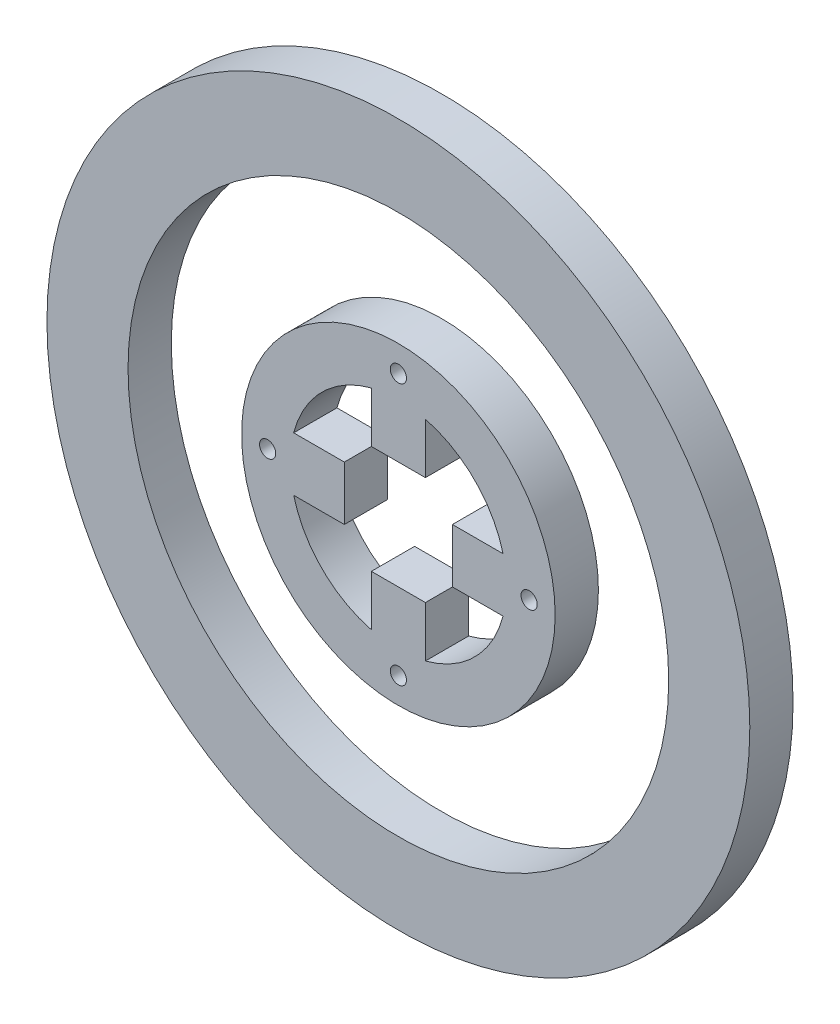
ISO-10303-21;
HEADER;
FILE_DESCRIPTION(('STEP AP214'),'2;1');
FILE_NAME('part.step','',(''),(''),'','','');
FILE_SCHEMA(('AUTOMOTIVE_DESIGN { 1 0 10303 214 1 1 1 1 }'));
ENDSEC;
DATA;
#1=APPLICATION_CONTEXT('core data for automotive mechanical design processes');
#2=APPLICATION_PROTOCOL_DEFINITION('international standard','automotive_design',2000,#1);
#3=PRODUCT_CONTEXT('',#1,'mechanical');
#4=PRODUCT('Part','Part','',(#3));
#5=PRODUCT_RELATED_PRODUCT_CATEGORY('part','',(#4));
#6=PRODUCT_DEFINITION_FORMATION('','',#4);
#7=PRODUCT_DEFINITION_CONTEXT('part definition',#1,'design');
#8=PRODUCT_DEFINITION('design','',#6,#7);
#9=PRODUCT_DEFINITION_SHAPE('','',#8);
#10=(LENGTH_UNIT() NAMED_UNIT(*) SI_UNIT(.MILLI.,.METRE.));
#11=(NAMED_UNIT(*) PLANE_ANGLE_UNIT() SI_UNIT($,.RADIAN.));
#12=(NAMED_UNIT(*) SI_UNIT($,.STERADIAN.) SOLID_ANGLE_UNIT());
#13=UNCERTAINTY_MEASURE_WITH_UNIT(LENGTH_MEASURE(1.E-05),#10,'distance_accuracy_value','');
#14=(GEOMETRIC_REPRESENTATION_CONTEXT(3) GLOBAL_UNCERTAINTY_ASSIGNED_CONTEXT((#13)) GLOBAL_UNIT_ASSIGNED_CONTEXT((#10,
#11,#12)) REPRESENTATION_CONTEXT('',''));
#15=CARTESIAN_POINT('',(0.,0.,0.));
#16=DIRECTION('',(0.,0.,1.));
#17=DIRECTION('',(1.,0.,0.));
#18=AXIS2_PLACEMENT_3D('',#15,#16,#17);
#19=CARTESIAN_POINT('',(0.,0.,0.));
#20=DIRECTION('',(0.,0.,1.));
#21=DIRECTION('',(1.,0.,0.));
#22=AXIS2_PLACEMENT_3D('',#19,#20,#21);
#23=CYLINDRICAL_SURFACE('',#22,20.);
#24=DIRECTION('',(0.,0.,1.));
#25=VECTOR('',#24,1.);
#26=CARTESIAN_POINT('',(-5.,-19.3649167310371,0.));
#27=LINE('',#26,#25);
#28=CARTESIAN_POINT('',(-5.,-19.3649167310371,0.));
#29=VERTEX_POINT('',#28);
#30=CARTESIAN_POINT('',(-5.,-19.3649167310371,8.));
#31=VERTEX_POINT('',#30);
#32=EDGE_CURVE('E71',#29,#31,#27,.T.);
#33=ORIENTED_EDGE('',*,*,#32,.F.);
#34=CARTESIAN_POINT('',(0.,0.,0.));
#35=DIRECTION('',(0.,0.,1.));
#36=DIRECTION('',(1.,0.,0.));
#37=AXIS2_PLACEMENT_3D('',#34,#35,#36);
#38=CIRCLE('',#37,20.);
#39=CARTESIAN_POINT('',(-19.3649167310371,-5.,0.));
#40=VERTEX_POINT('',#39);
#41=EDGE_CURVE('E366',#40,#29,#38,.T.);
#42=ORIENTED_EDGE('',*,*,#41,.F.);
#43=DIRECTION('',(0.,0.,1.));
#44=VECTOR('',#43,1.);
#45=CARTESIAN_POINT('',(-19.3649167310371,-5.,0.));
#46=LINE('',#45,#44);
#47=CARTESIAN_POINT('',(-19.3649167310371,-5.,8.));
#48=VERTEX_POINT('',#47);
#49=EDGE_CURVE('E209',#40,#48,#46,.T.);
#50=ORIENTED_EDGE('',*,*,#49,.T.);
#51=CARTESIAN_POINT('',(0.,0.,8.));
#52=DIRECTION('',(0.,0.,1.));
#53=DIRECTION('',(1.,0.,0.));
#54=AXIS2_PLACEMENT_3D('',#51,#52,#53);
#55=CIRCLE('',#54,20.);
#56=EDGE_CURVE('E382',#48,#31,#55,.T.);
#57=ORIENTED_EDGE('',*,*,#56,.T.);
#58=EDGE_LOOP('',(#33,#42,#50,#57));
#59=FACE_BOUND('',#58,.T.);
#60=ADVANCED_FACE('F46',(#59),#23,.F.);
#61=DIRECTION('',(0.,0.,1.));
#62=VECTOR('',#61,1.);
#63=CARTESIAN_POINT('',(-19.3649167310371,5.,0.));
#64=LINE('',#63,#62);
#65=CARTESIAN_POINT('',(-19.3649167310371,5.,0.));
#66=VERTEX_POINT('',#65);
#67=CARTESIAN_POINT('',(-19.3649167310371,5.,8.));
#68=VERTEX_POINT('',#67);
#69=EDGE_CURVE('E216',#66,#68,#64,.T.);
#70=ORIENTED_EDGE('',*,*,#69,.F.);
#71=CARTESIAN_POINT('',(-5.,19.3649167310371,0.));
#72=VERTEX_POINT('',#71);
#73=EDGE_CURVE('E283',#72,#66,#38,.T.);
#74=ORIENTED_EDGE('',*,*,#73,.F.);
#75=DIRECTION('',(0.,0.,1.));
#76=VECTOR('',#75,1.);
#77=CARTESIAN_POINT('',(-5.,19.3649167310371,0.));
#78=LINE('',#77,#76);
#79=CARTESIAN_POINT('',(-5.,19.3649167310371,8.));
#80=VERTEX_POINT('',#79);
#81=EDGE_CURVE('E249',#72,#80,#78,.T.);
#82=ORIENTED_EDGE('',*,*,#81,.T.);
#83=EDGE_CURVE('E285',#80,#68,#55,.T.);
#84=ORIENTED_EDGE('',*,*,#83,.T.);
#85=EDGE_LOOP('',(#70,#74,#82,#84));
#86=FACE_BOUND('',#85,.T.);
#87=ADVANCED_FACE('F327',(#86),#23,.F.);
#88=DIRECTION('',(0.,0.,1.));
#89=VECTOR('',#88,1.);
#90=CARTESIAN_POINT('',(5.,19.3649167310371,0.));
#91=LINE('',#90,#89);
#92=CARTESIAN_POINT('',(5.,19.3649167310371,0.));
#93=VERTEX_POINT('',#92);
#94=CARTESIAN_POINT('',(5.,19.3649167310371,8.));
#95=VERTEX_POINT('',#94);
#96=EDGE_CURVE('E236',#93,#95,#91,.T.);
#97=ORIENTED_EDGE('',*,*,#96,.F.);
#98=CARTESIAN_POINT('',(19.3649167310371,5.,0.));
#99=VERTEX_POINT('',#98);
#100=EDGE_CURVE('E281',#99,#93,#38,.T.);
#101=ORIENTED_EDGE('',*,*,#100,.F.);
#102=DIRECTION('',(0.,0.,1.));
#103=VECTOR('',#102,1.);
#104=CARTESIAN_POINT('',(19.3649167310371,5.,0.));
#105=LINE('',#104,#103);
#106=CARTESIAN_POINT('',(19.3649167310371,5.,8.));
#107=VERTEX_POINT('',#106);
#108=EDGE_CURVE('E276',#99,#107,#105,.T.);
#109=ORIENTED_EDGE('',*,*,#108,.T.);
#110=EDGE_CURVE('E284',#107,#95,#55,.T.);
#111=ORIENTED_EDGE('',*,*,#110,.T.);
#112=EDGE_LOOP('',(#97,#101,#109,#111));
#113=FACE_BOUND('',#112,.T.);
#114=ADVANCED_FACE('F333',(#113),#23,.F.);
#115=CARTESIAN_POINT('',(5.,-19.3649167310371,0.));
#116=VERTEX_POINT('',#115);
#117=CARTESIAN_POINT('',(19.3649167310371,-5.,0.));
#118=VERTEX_POINT('',#117);
#119=EDGE_CURVE('E63',#116,#118,#38,.T.);
#120=ORIENTED_EDGE('',*,*,#119,.F.);
#121=DIRECTION('',(0.,0.,1.));
#122=VECTOR('',#121,1.);
#123=CARTESIAN_POINT('',(5.,-19.3649167310371,0.));
#124=LINE('',#123,#122);
#125=CARTESIAN_POINT('',(5.,-19.3649167310371,8.));
#126=VERTEX_POINT('',#125);
#127=EDGE_CURVE('E183',#116,#126,#124,.T.);
#128=ORIENTED_EDGE('',*,*,#127,.T.);
#129=CARTESIAN_POINT('',(19.3649167310371,-5.,8.));
#130=VERTEX_POINT('',#129);
#131=EDGE_CURVE('E273',#126,#130,#55,.T.);
#132=ORIENTED_EDGE('',*,*,#131,.T.);
#133=DIRECTION('',(0.,0.,1.));
#134=VECTOR('',#133,1.);
#135=CARTESIAN_POINT('',(19.3649167310371,-5.,0.));
#136=LINE('',#135,#134);
#137=EDGE_CURVE('E263',#118,#130,#136,.T.);
#138=ORIENTED_EDGE('',*,*,#137,.F.);
#139=EDGE_LOOP('',(#120,#128,#132,#138));
#140=FACE_BOUND('',#139,.T.);
#141=ADVANCED_FACE('F329',(#140),#23,.F.);
#142=CARTESIAN_POINT('',(0.,0.,0.));
#143=DIRECTION('',(0.,0.,1.));
#144=DIRECTION('',(1.,0.,0.));
#145=AXIS2_PLACEMENT_3D('',#142,#143,#144);
#146=CYLINDRICAL_SURFACE('',#145,29.);
#147=CARTESIAN_POINT('',(0.,0.,0.));
#148=DIRECTION('',(0.,0.,1.));
#149=DIRECTION('',(1.,0.,0.));
#150=AXIS2_PLACEMENT_3D('',#147,#148,#149);
#151=CIRCLE('',#150,29.);
#152=CARTESIAN_POINT('',(29.,0.,0.));
#153=VERTEX_POINT('',#152);
#154=EDGE_CURVE('E12',#153,#153,#151,.T.);
#155=ORIENTED_EDGE('',*,*,#154,.T.);
#156=EDGE_LOOP('',(#155));
#157=FACE_BOUND('',#156,.T.);
#158=CARTESIAN_POINT('',(0.,0.,8.));
#159=DIRECTION('',(0.,0.,1.));
#160=DIRECTION('',(1.,0.,0.));
#161=AXIS2_PLACEMENT_3D('',#158,#159,#160);
#162=CIRCLE('',#161,29.);
#163=CARTESIAN_POINT('',(29.,0.,8.));
#164=VERTEX_POINT('',#163);
#165=EDGE_CURVE('E55',#164,#164,#162,.T.);
#166=ORIENTED_EDGE('',*,*,#165,.F.);
#167=EDGE_LOOP('',(#166));
#168=FACE_BOUND('',#167,.T.);
#169=ADVANCED_FACE('F48',(#157,#168),#146,.T.);
#170=CARTESIAN_POINT('',(0.,0.,0.));
#171=DIRECTION('',(0.,0.,1.));
#172=DIRECTION('',(1.,0.,0.));
#173=AXIS2_PLACEMENT_3D('',#170,#171,#172);
#174=PLANE('',#173);
#175=CARTESIAN_POINT('',(0.,24.1824583655185,0.));
#176=DIRECTION('',(0.,0.,1.));
#177=DIRECTION('',(1.,0.,0.));
#178=AXIS2_PLACEMENT_3D('',#175,#176,#177);
#179=CIRCLE('',#178,1.5);
#180=CARTESIAN_POINT('',(1.5,24.1824583655185,0.));
#181=VERTEX_POINT('',#180);
#182=EDGE_CURVE('E194',#181,#181,#179,.F.);
#183=ORIENTED_EDGE('',*,*,#182,.F.);
#184=EDGE_LOOP('',(#183));
#185=FACE_BOUND('',#184,.T.);
#186=CARTESIAN_POINT('',(24.1824583655185,0.,0.));
#187=DIRECTION('',(0.,0.,1.));
#188=DIRECTION('',(1.,0.,0.));
#189=AXIS2_PLACEMENT_3D('',#186,#187,#188);
#190=CIRCLE('',#189,1.5);
#191=CARTESIAN_POINT('',(25.6824583655185,0.,0.));
#192=VERTEX_POINT('',#191);
#193=EDGE_CURVE('E298',#192,#192,#190,.F.);
#194=ORIENTED_EDGE('',*,*,#193,.F.);
#195=EDGE_LOOP('',(#194));
#196=FACE_BOUND('',#195,.T.);
#197=CARTESIAN_POINT('',(0.,-24.1824583655185,0.));
#198=DIRECTION('',(0.,0.,1.));
#199=DIRECTION('',(1.,0.,0.));
#200=AXIS2_PLACEMENT_3D('',#197,#198,#199);
#201=CIRCLE('',#200,1.5);
#202=CARTESIAN_POINT('',(1.5,-24.1824583655185,0.));
#203=VERTEX_POINT('',#202);
#204=EDGE_CURVE('E295',#203,#203,#201,.F.);
#205=ORIENTED_EDGE('',*,*,#204,.F.);
#206=EDGE_LOOP('',(#205));
#207=FACE_BOUND('',#206,.T.);
#208=CARTESIAN_POINT('',(-24.1824583655185,0.,0.));
#209=DIRECTION('',(0.,0.,1.));
#210=DIRECTION('',(1.,0.,0.));
#211=AXIS2_PLACEMENT_3D('',#208,#209,#210);
#212=CIRCLE('',#211,1.5);
#213=CARTESIAN_POINT('',(-22.6824583655185,0.,0.));
#214=VERTEX_POINT('',#213);
#215=EDGE_CURVE('E292',#214,#214,#212,.F.);
#216=ORIENTED_EDGE('',*,*,#215,.F.);
#217=EDGE_LOOP('',(#216));
#218=FACE_BOUND('',#217,.T.);
#219=ORIENTED_EDGE('',*,*,#100,.T.);
#220=DIRECTION('',(0.,-1.,0.));
#221=VECTOR('',#220,1.);
#222=CARTESIAN_POINT('',(4.99999999999994,0.,0.));
#223=LINE('',#222,#221);
#224=CARTESIAN_POINT('',(4.99999999999997,9.99999673103708,0.));
#225=VERTEX_POINT('',#224);
#226=EDGE_CURVE('E227',#93,#225,#223,.T.);
#227=ORIENTED_EDGE('',*,*,#226,.T.);
#228=DIRECTION('',(1.,0.,0.));
#229=VECTOR('',#228,1.);
#230=CARTESIAN_POINT('',(0.,9.99999673103708,0.));
#231=LINE('',#230,#229);
#232=CARTESIAN_POINT('',(-5.,9.99999673103708,0.));
#233=VERTEX_POINT('',#232);
#234=EDGE_CURVE('E233',#233,#225,#231,.T.);
#235=ORIENTED_EDGE('',*,*,#234,.F.);
#236=DIRECTION('',(0.,-1.,0.));
#237=VECTOR('',#236,1.);
#238=CARTESIAN_POINT('',(-5.,0.,0.));
#239=LINE('',#238,#237);
#240=EDGE_CURVE('E229',#72,#233,#239,.T.);
#241=ORIENTED_EDGE('',*,*,#240,.F.);
#242=ORIENTED_EDGE('',*,*,#73,.T.);
#243=DIRECTION('',(1.,0.,0.));
#244=VECTOR('',#243,1.);
#245=CARTESIAN_POINT('',(0.,5.00000000000001,0.));
#246=LINE('',#245,#244);
#247=CARTESIAN_POINT('',(-9.99999673103708,5.,0.));
#248=VERTEX_POINT('',#247);
#249=EDGE_CURVE('E207',#66,#248,#246,.T.);
#250=ORIENTED_EDGE('',*,*,#249,.T.);
#251=DIRECTION('',(0.,-1.,0.));
#252=VECTOR('',#251,1.);
#253=CARTESIAN_POINT('',(-9.99999673103708,0.,0.));
#254=LINE('',#253,#252);
#255=CARTESIAN_POINT('',(-9.99999673103708,-5.,0.));
#256=VERTEX_POINT('',#255);
#257=EDGE_CURVE('E204',#248,#256,#254,.T.);
#258=ORIENTED_EDGE('',*,*,#257,.T.);
#259=DIRECTION('',(1.,0.,0.));
#260=VECTOR('',#259,1.);
#261=CARTESIAN_POINT('',(0.,-5.,0.));
#262=LINE('',#261,#260);
#263=EDGE_CURVE('E201',#40,#256,#262,.T.);
#264=ORIENTED_EDGE('',*,*,#263,.F.);
#265=ORIENTED_EDGE('',*,*,#41,.T.);
#266=DIRECTION('',(0.,1.,0.));
#267=VECTOR('',#266,1.);
#268=CARTESIAN_POINT('',(-5.,0.,0.));
#269=LINE('',#268,#267);
#270=CARTESIAN_POINT('',(-5.,-9.99999673103708,0.));
#271=VERTEX_POINT('',#270);
#272=EDGE_CURVE('E170',#29,#271,#269,.T.);
#273=ORIENTED_EDGE('',*,*,#272,.T.);
#274=DIRECTION('',(1.,0.,0.));
#275=VECTOR('',#274,1.);
#276=CARTESIAN_POINT('',(0.,-9.99999673103708,0.));
#277=LINE('',#276,#275);
#278=CARTESIAN_POINT('',(5.,-9.99999673103708,0.));
#279=VERTEX_POINT('',#278);
#280=EDGE_CURVE('E162',#271,#279,#277,.T.);
#281=ORIENTED_EDGE('',*,*,#280,.T.);
#282=DIRECTION('',(0.,1.,0.));
#283=VECTOR('',#282,1.);
#284=CARTESIAN_POINT('',(4.99999999999999,0.,0.));
#285=LINE('',#284,#283);
#286=EDGE_CURVE('E168',#116,#279,#285,.T.);
#287=ORIENTED_EDGE('',*,*,#286,.F.);
#288=ORIENTED_EDGE('',*,*,#119,.T.);
#289=DIRECTION('',(-1.,0.,0.));
#290=VECTOR('',#289,1.);
#291=CARTESIAN_POINT('',(0.,-5.00000000000002,0.));
#292=LINE('',#291,#290);
#293=CARTESIAN_POINT('',(9.99999673103709,-5.00000000000001,0.));
#294=VERTEX_POINT('',#293);
#295=EDGE_CURVE('E254',#118,#294,#292,.T.);
#296=ORIENTED_EDGE('',*,*,#295,.T.);
#297=DIRECTION('',(0.,-1.,0.));
#298=VECTOR('',#297,1.);
#299=CARTESIAN_POINT('',(9.99999673103709,0.,0.));
#300=LINE('',#299,#298);
#301=CARTESIAN_POINT('',(9.99999673103709,5.00000000000001,0.));
#302=VERTEX_POINT('',#301);
#303=EDGE_CURVE('E260',#302,#294,#300,.T.);
#304=ORIENTED_EDGE('',*,*,#303,.F.);
#305=DIRECTION('',(-1.,0.,0.));
#306=VECTOR('',#305,1.);
#307=CARTESIAN_POINT('',(0.,5.00000000000002,0.));
#308=LINE('',#307,#306);
#309=EDGE_CURVE('E256',#99,#302,#308,.T.);
#310=ORIENTED_EDGE('',*,*,#309,.F.);
#311=EDGE_LOOP('',(#219,#227,#235,#241,#242,#250,#258,#264,#265,#273,#281,#287,#288,#296,#304,#310));
#312=FACE_BOUND('',#311,.T.);
#313=ORIENTED_EDGE('',*,*,#154,.F.);
#314=EDGE_LOOP('',(#313));
#315=FACE_BOUND('',#314,.T.);
#316=ADVANCED_FACE('F165',(#185,#196,#207,#218,#312,#315),#174,.F.);
#317=CARTESIAN_POINT('',(0.,0.,8.));
#318=DIRECTION('',(0.,0.,1.));
#319=DIRECTION('',(1.,0.,0.));
#320=AXIS2_PLACEMENT_3D('',#317,#318,#319);
#321=PLANE('',#320);
#322=CARTESIAN_POINT('',(0.,24.1824583655185,8.));
#323=DIRECTION('',(0.,0.,1.));
#324=DIRECTION('',(1.,0.,0.));
#325=AXIS2_PLACEMENT_3D('',#322,#323,#324);
#326=CIRCLE('',#325,1.5);
#327=CARTESIAN_POINT('',(1.5,24.1824583655185,8.));
#328=VERTEX_POINT('',#327);
#329=EDGE_CURVE('E50',#328,#328,#326,.F.);
#330=ORIENTED_EDGE('',*,*,#329,.T.);
#331=EDGE_LOOP('',(#330));
#332=FACE_BOUND('',#331,.T.);
#333=CARTESIAN_POINT('',(24.1824583655185,0.,8.));
#334=DIRECTION('',(0.,0.,1.));
#335=DIRECTION('',(1.,0.,0.));
#336=AXIS2_PLACEMENT_3D('',#333,#334,#335);
#337=CIRCLE('',#336,1.5);
#338=CARTESIAN_POINT('',(25.6824583655185,0.,8.));
#339=VERTEX_POINT('',#338);
#340=EDGE_CURVE('E296',#339,#339,#337,.F.);
#341=ORIENTED_EDGE('',*,*,#340,.T.);
#342=EDGE_LOOP('',(#341));
#343=FACE_BOUND('',#342,.T.);
#344=CARTESIAN_POINT('',(0.,-24.1824583655185,8.));
#345=DIRECTION('',(0.,0.,1.));
#346=DIRECTION('',(1.,0.,0.));
#347=AXIS2_PLACEMENT_3D('',#344,#345,#346);
#348=CIRCLE('',#347,1.5);
#349=CARTESIAN_POINT('',(1.5,-24.1824583655185,8.));
#350=VERTEX_POINT('',#349);
#351=EDGE_CURVE('E293',#350,#350,#348,.F.);
#352=ORIENTED_EDGE('',*,*,#351,.T.);
#353=EDGE_LOOP('',(#352));
#354=FACE_BOUND('',#353,.T.);
#355=CARTESIAN_POINT('',(-24.1824583655185,0.,8.));
#356=DIRECTION('',(0.,0.,1.));
#357=DIRECTION('',(1.,0.,0.));
#358=AXIS2_PLACEMENT_3D('',#355,#356,#357);
#359=CIRCLE('',#358,1.5);
#360=CARTESIAN_POINT('',(-22.6824583655185,0.,8.));
#361=VERTEX_POINT('',#360);
#362=EDGE_CURVE('E289',#361,#361,#359,.F.);
#363=ORIENTED_EDGE('',*,*,#362,.T.);
#364=EDGE_LOOP('',(#363));
#365=FACE_BOUND('',#364,.T.);
#366=ORIENTED_EDGE('',*,*,#110,.F.);
#367=DIRECTION('',(-1.,0.,0.));
#368=VECTOR('',#367,1.);
#369=CARTESIAN_POINT('',(0.,5.00000000000002,8.));
#370=LINE('',#369,#368);
#371=CARTESIAN_POINT('',(9.99999673103709,5.00000000000001,8.));
#372=VERTEX_POINT('',#371);
#373=EDGE_CURVE('E266',#107,#372,#370,.T.);
#374=ORIENTED_EDGE('',*,*,#373,.T.);
#375=DIRECTION('',(0.,-1.,0.));
#376=VECTOR('',#375,1.);
#377=CARTESIAN_POINT('',(9.99999673103709,0.,8.));
#378=LINE('',#377,#376);
#379=CARTESIAN_POINT('',(9.99999673103709,-5.00000000000001,8.));
#380=VERTEX_POINT('',#379);
#381=EDGE_CURVE('E257',#372,#380,#378,.T.);
#382=ORIENTED_EDGE('',*,*,#381,.T.);
#383=DIRECTION('',(-1.,0.,0.));
#384=VECTOR('',#383,1.);
#385=CARTESIAN_POINT('',(0.,-5.00000000000002,8.));
#386=LINE('',#385,#384);
#387=EDGE_CURVE('E246',#130,#380,#386,.T.);
#388=ORIENTED_EDGE('',*,*,#387,.F.);
#389=ORIENTED_EDGE('',*,*,#131,.F.);
#390=DIRECTION('',(0.,1.,0.));
#391=VECTOR('',#390,1.);
#392=CARTESIAN_POINT('',(4.99999999999999,0.,8.));
#393=LINE('',#392,#391);
#394=CARTESIAN_POINT('',(5.,-9.99999673103708,8.));
#395=VERTEX_POINT('',#394);
#396=EDGE_CURVE('E193',#126,#395,#393,.T.);
#397=ORIENTED_EDGE('',*,*,#396,.T.);
#398=DIRECTION('',(1.,0.,0.));
#399=VECTOR('',#398,1.);
#400=CARTESIAN_POINT('',(0.,-9.99999673103708,8.));
#401=LINE('',#400,#399);
#402=CARTESIAN_POINT('',(-5.,-9.99999673103708,8.));
#403=VERTEX_POINT('',#402);
#404=EDGE_CURVE('E178',#403,#395,#401,.T.);
#405=ORIENTED_EDGE('',*,*,#404,.F.);
#406=DIRECTION('',(0.,1.,0.));
#407=VECTOR('',#406,1.);
#408=CARTESIAN_POINT('',(-5.,0.,8.));
#409=LINE('',#408,#407);
#410=EDGE_CURVE('E190',#31,#403,#409,.T.);
#411=ORIENTED_EDGE('',*,*,#410,.F.);
#412=ORIENTED_EDGE('',*,*,#56,.F.);
#413=DIRECTION('',(1.,0.,0.));
#414=VECTOR('',#413,1.);
#415=CARTESIAN_POINT('',(0.,-5.,8.));
#416=LINE('',#415,#414);
#417=CARTESIAN_POINT('',(-9.99999673103708,-5.,8.));
#418=VERTEX_POINT('',#417);
#419=EDGE_CURVE('E197',#48,#418,#416,.T.);
#420=ORIENTED_EDGE('',*,*,#419,.T.);
#421=DIRECTION('',(0.,-1.,0.));
#422=VECTOR('',#421,1.);
#423=CARTESIAN_POINT('',(-9.99999673103708,0.,8.));
#424=LINE('',#423,#422);
#425=CARTESIAN_POINT('',(-9.99999673103708,5.,8.));
#426=VERTEX_POINT('',#425);
#427=EDGE_CURVE('E212',#426,#418,#424,.T.);
#428=ORIENTED_EDGE('',*,*,#427,.F.);
#429=DIRECTION('',(1.,0.,0.));
#430=VECTOR('',#429,1.);
#431=CARTESIAN_POINT('',(0.,5.00000000000001,8.));
#432=LINE('',#431,#430);
#433=EDGE_CURVE('E205',#68,#426,#432,.T.);
#434=ORIENTED_EDGE('',*,*,#433,.F.);
#435=ORIENTED_EDGE('',*,*,#83,.F.);
#436=DIRECTION('',(0.,-1.,0.));
#437=VECTOR('',#436,1.);
#438=CARTESIAN_POINT('',(-5.,0.,8.));
#439=LINE('',#438,#437);
#440=CARTESIAN_POINT('',(-5.,9.99999673103708,8.));
#441=VERTEX_POINT('',#440);
#442=EDGE_CURVE('E239',#80,#441,#439,.T.);
#443=ORIENTED_EDGE('',*,*,#442,.T.);
#444=DIRECTION('',(1.,0.,0.));
#445=VECTOR('',#444,1.);
#446=CARTESIAN_POINT('',(0.,9.99999673103708,8.));
#447=LINE('',#446,#445);
#448=CARTESIAN_POINT('',(4.99999999999997,9.99999673103708,8.));
#449=VERTEX_POINT('',#448);
#450=EDGE_CURVE('E230',#441,#449,#447,.T.);
#451=ORIENTED_EDGE('',*,*,#450,.T.);
#452=DIRECTION('',(0.,-1.,0.));
#453=VECTOR('',#452,1.);
#454=CARTESIAN_POINT('',(4.99999999999994,0.,8.));
#455=LINE('',#454,#453);
#456=EDGE_CURVE('E219',#95,#449,#455,.T.);
#457=ORIENTED_EDGE('',*,*,#456,.F.);
#458=EDGE_LOOP('',(#366,#374,#382,#388,#389,#397,#405,#411,#412,#420,#428,#434,#435,#443,#451,#457));
#459=FACE_BOUND('',#458,.T.);
#460=ORIENTED_EDGE('',*,*,#165,.T.);
#461=EDGE_LOOP('',(#460));
#462=FACE_BOUND('',#461,.T.);
#463=ADVANCED_FACE('F314',(#332,#343,#354,#365,#459,#462),#321,.T.);
#464=CARTESIAN_POINT('',(0.,-5.00000000000002,0.));
#465=DIRECTION('',(0.,1.,0.));
#466=DIRECTION('',(-1.,0.,0.));
#467=AXIS2_PLACEMENT_3D('',#464,#465,#466);
#468=PLANE('',#467);
#469=ORIENTED_EDGE('',*,*,#387,.T.);
#470=DIRECTION('',(0.,0.,1.));
#471=VECTOR('',#470,1.);
#472=CARTESIAN_POINT('',(9.99999673103709,-5.00000000000001,0.));
#473=LINE('',#472,#471);
#474=EDGE_CURVE('E271',#294,#380,#473,.T.);
#475=ORIENTED_EDGE('',*,*,#474,.F.);
#476=ORIENTED_EDGE('',*,*,#295,.F.);
#477=ORIENTED_EDGE('',*,*,#137,.T.);
#478=EDGE_LOOP('',(#469,#475,#476,#477));
#479=FACE_BOUND('',#478,.T.);
#480=ADVANCED_FACE('F372',(#479),#468,.F.);
#481=CARTESIAN_POINT('',(9.99999673103709,0.,0.));
#482=DIRECTION('',(-1.,0.,0.));
#483=DIRECTION('',(0.,-1.,0.));
#484=AXIS2_PLACEMENT_3D('',#481,#482,#483);
#485=PLANE('',#484);
#486=ORIENTED_EDGE('',*,*,#381,.F.);
#487=DIRECTION('',(0.,0.,1.));
#488=VECTOR('',#487,1.);
#489=CARTESIAN_POINT('',(9.99999673103709,5.00000000000001,0.));
#490=LINE('',#489,#488);
#491=EDGE_CURVE('E274',#302,#372,#490,.T.);
#492=ORIENTED_EDGE('',*,*,#491,.F.);
#493=ORIENTED_EDGE('',*,*,#303,.T.);
#494=ORIENTED_EDGE('',*,*,#474,.T.);
#495=EDGE_LOOP('',(#486,#492,#493,#494));
#496=FACE_BOUND('',#495,.T.);
#497=ADVANCED_FACE('F375',(#496),#485,.T.);
#498=CARTESIAN_POINT('',(0.,5.00000000000002,0.));
#499=DIRECTION('',(0.,1.,0.));
#500=DIRECTION('',(-1.,0.,0.));
#501=AXIS2_PLACEMENT_3D('',#498,#499,#500);
#502=PLANE('',#501);
#503=ORIENTED_EDGE('',*,*,#373,.F.);
#504=ORIENTED_EDGE('',*,*,#108,.F.);
#505=ORIENTED_EDGE('',*,*,#309,.T.);
#506=ORIENTED_EDGE('',*,*,#491,.T.);
#507=EDGE_LOOP('',(#503,#504,#505,#506));
#508=FACE_BOUND('',#507,.T.);
#509=ADVANCED_FACE('F378',(#508),#502,.T.);
#510=CARTESIAN_POINT('',(4.99999999999994,0.,0.));
#511=DIRECTION('',(-1.,0.,0.));
#512=DIRECTION('',(0.,-1.,0.));
#513=AXIS2_PLACEMENT_3D('',#510,#511,#512);
#514=PLANE('',#513);
#515=ORIENTED_EDGE('',*,*,#456,.T.);
#516=DIRECTION('',(0.,0.,1.));
#517=VECTOR('',#516,1.);
#518=CARTESIAN_POINT('',(4.99999999999997,9.99999673103708,0.));
#519=LINE('',#518,#517);
#520=EDGE_CURVE('E244',#225,#449,#519,.T.);
#521=ORIENTED_EDGE('',*,*,#520,.F.);
#522=ORIENTED_EDGE('',*,*,#226,.F.);
#523=ORIENTED_EDGE('',*,*,#96,.T.);
#524=EDGE_LOOP('',(#515,#521,#522,#523));
#525=FACE_BOUND('',#524,.T.);
#526=ADVANCED_FACE('F354',(#525),#514,.F.);
#527=CARTESIAN_POINT('',(0.,9.99999673103708,0.));
#528=DIRECTION('',(0.,-1.,0.));
#529=DIRECTION('',(0.,0.,-1.));
#530=AXIS2_PLACEMENT_3D('',#527,#528,#529);
#531=PLANE('',#530);
#532=ORIENTED_EDGE('',*,*,#450,.F.);
#533=DIRECTION('',(0.,0.,1.));
#534=VECTOR('',#533,1.);
#535=CARTESIAN_POINT('',(-5.,9.99999673103708,0.));
#536=LINE('',#535,#534);
#537=EDGE_CURVE('E247',#233,#441,#536,.T.);
#538=ORIENTED_EDGE('',*,*,#537,.F.);
#539=ORIENTED_EDGE('',*,*,#234,.T.);
#540=ORIENTED_EDGE('',*,*,#520,.T.);
#541=EDGE_LOOP('',(#532,#538,#539,#540));
#542=FACE_BOUND('',#541,.T.);
#543=ADVANCED_FACE('F357',(#542),#531,.T.);
#544=CARTESIAN_POINT('',(-5.,0.,0.));
#545=DIRECTION('',(-1.,0.,0.));
#546=DIRECTION('',(0.,-1.,0.));
#547=AXIS2_PLACEMENT_3D('',#544,#545,#546);
#548=PLANE('',#547);
#549=ORIENTED_EDGE('',*,*,#442,.F.);
#550=ORIENTED_EDGE('',*,*,#81,.F.);
#551=ORIENTED_EDGE('',*,*,#240,.T.);
#552=ORIENTED_EDGE('',*,*,#537,.T.);
#553=EDGE_LOOP('',(#549,#550,#551,#552));
#554=FACE_BOUND('',#553,.T.);
#555=ADVANCED_FACE('F364',(#554),#548,.T.);
#556=CARTESIAN_POINT('',(0.,5.00000000000001,0.));
#557=DIRECTION('',(0.,-1.,0.));
#558=DIRECTION('',(1.,0.,0.));
#559=AXIS2_PLACEMENT_3D('',#556,#557,#558);
#560=PLANE('',#559);
#561=ORIENTED_EDGE('',*,*,#433,.T.);
#562=DIRECTION('',(0.,0.,1.));
#563=VECTOR('',#562,1.);
#564=CARTESIAN_POINT('',(-9.99999673103708,5.,0.));
#565=LINE('',#564,#563);
#566=EDGE_CURVE('E220',#248,#426,#565,.T.);
#567=ORIENTED_EDGE('',*,*,#566,.F.);
#568=ORIENTED_EDGE('',*,*,#249,.F.);
#569=ORIENTED_EDGE('',*,*,#69,.T.);
#570=EDGE_LOOP('',(#561,#567,#568,#569));
#571=FACE_BOUND('',#570,.T.);
#572=ADVANCED_FACE('F401',(#571),#560,.F.);
#573=CARTESIAN_POINT('',(-9.99999673103708,0.,0.));
#574=DIRECTION('',(-1.,0.,0.));
#575=DIRECTION('',(0.,-1.,0.));
#576=AXIS2_PLACEMENT_3D('',#573,#574,#575);
#577=PLANE('',#576);
#578=ORIENTED_EDGE('',*,*,#427,.T.);
#579=DIRECTION('',(0.,0.,1.));
#580=VECTOR('',#579,1.);
#581=CARTESIAN_POINT('',(-9.99999673103708,-5.,0.));
#582=LINE('',#581,#580);
#583=EDGE_CURVE('E223',#256,#418,#582,.T.);
#584=ORIENTED_EDGE('',*,*,#583,.F.);
#585=ORIENTED_EDGE('',*,*,#257,.F.);
#586=ORIENTED_EDGE('',*,*,#566,.T.);
#587=EDGE_LOOP('',(#578,#584,#585,#586));
#588=FACE_BOUND('',#587,.T.);
#589=ADVANCED_FACE('F396',(#588),#577,.F.);
#590=CARTESIAN_POINT('',(0.,-5.,0.));
#591=DIRECTION('',(0.,-1.,0.));
#592=DIRECTION('',(1.,0.,0.));
#593=AXIS2_PLACEMENT_3D('',#590,#591,#592);
#594=PLANE('',#593);
#595=ORIENTED_EDGE('',*,*,#419,.F.);
#596=ORIENTED_EDGE('',*,*,#49,.F.);
#597=ORIENTED_EDGE('',*,*,#263,.T.);
#598=ORIENTED_EDGE('',*,*,#583,.T.);
#599=EDGE_LOOP('',(#595,#596,#597,#598));
#600=FACE_BOUND('',#599,.T.);
#601=ADVANCED_FACE('F389',(#600),#594,.T.);
#602=CARTESIAN_POINT('',(-5.,0.,0.));
#603=DIRECTION('',(1.,0.,0.));
#604=DIRECTION('',(0.,1.,0.));
#605=AXIS2_PLACEMENT_3D('',#602,#603,#604);
#606=PLANE('',#605);
#607=ORIENTED_EDGE('',*,*,#410,.T.);
#608=DIRECTION('',(0.,0.,1.));
#609=VECTOR('',#608,1.);
#610=CARTESIAN_POINT('',(-5.,-9.99999673103708,0.));
#611=LINE('',#610,#609);
#612=EDGE_CURVE('E182',#271,#403,#611,.T.);
#613=ORIENTED_EDGE('',*,*,#612,.F.);
#614=ORIENTED_EDGE('',*,*,#272,.F.);
#615=ORIENTED_EDGE('',*,*,#32,.T.);
#616=EDGE_LOOP('',(#607,#613,#614,#615));
#617=FACE_BOUND('',#616,.T.);
#618=ADVANCED_FACE('F387',(#617),#606,.F.);
#619=CARTESIAN_POINT('',(0.,-9.99999673103708,0.));
#620=DIRECTION('',(0.,-1.,0.));
#621=DIRECTION('',(0.,0.,-1.));
#622=AXIS2_PLACEMENT_3D('',#619,#620,#621);
#623=PLANE('',#622);
#624=ORIENTED_EDGE('',*,*,#404,.T.);
#625=DIRECTION('',(0.,0.,1.));
#626=VECTOR('',#625,1.);
#627=CARTESIAN_POINT('',(5.,-9.99999673103708,0.));
#628=LINE('',#627,#626);
#629=EDGE_CURVE('E176',#279,#395,#628,.T.);
#630=ORIENTED_EDGE('',*,*,#629,.F.);
#631=ORIENTED_EDGE('',*,*,#280,.F.);
#632=ORIENTED_EDGE('',*,*,#612,.T.);
#633=EDGE_LOOP('',(#624,#630,#631,#632));
#634=FACE_BOUND('',#633,.T.);
#635=ADVANCED_FACE('F177',(#634),#623,.F.);
#636=CARTESIAN_POINT('',(4.99999999999999,0.,0.));
#637=DIRECTION('',(1.,0.,0.));
#638=DIRECTION('',(0.,1.,0.));
#639=AXIS2_PLACEMENT_3D('',#636,#637,#638);
#640=PLANE('',#639);
#641=ORIENTED_EDGE('',*,*,#396,.F.);
#642=ORIENTED_EDGE('',*,*,#127,.F.);
#643=ORIENTED_EDGE('',*,*,#286,.T.);
#644=ORIENTED_EDGE('',*,*,#629,.T.);
#645=EDGE_LOOP('',(#641,#642,#643,#644));
#646=FACE_BOUND('',#645,.T.);
#647=ADVANCED_FACE('F185',(#646),#640,.T.);
#648=CARTESIAN_POINT('',(-24.1824583655185,0.,46.));
#649=DIRECTION('',(0.,0.,-1.));
#650=DIRECTION('',(-1.,0.,0.));
#651=AXIS2_PLACEMENT_3D('',#648,#649,#650);
#652=CYLINDRICAL_SURFACE('',#651,1.5);
#653=ORIENTED_EDGE('',*,*,#362,.F.);
#654=EDGE_LOOP('',(#653));
#655=FACE_BOUND('',#654,.T.);
#656=ORIENTED_EDGE('',*,*,#215,.T.);
#657=EDGE_LOOP('',(#656));
#658=FACE_BOUND('',#657,.T.);
#659=ADVANCED_FACE('F434',(#655,#658),#652,.F.);
#660=CARTESIAN_POINT('',(0.,-24.1824583655185,46.));
#661=DIRECTION('',(0.,0.,-1.));
#662=DIRECTION('',(-1.,0.,0.));
#663=AXIS2_PLACEMENT_3D('',#660,#661,#662);
#664=CYLINDRICAL_SURFACE('',#663,1.5);
#665=ORIENTED_EDGE('',*,*,#351,.F.);
#666=EDGE_LOOP('',(#665));
#667=FACE_BOUND('',#666,.T.);
#668=ORIENTED_EDGE('',*,*,#204,.T.);
#669=EDGE_LOOP('',(#668));
#670=FACE_BOUND('',#669,.T.);
#671=ADVANCED_FACE('F323',(#667,#670),#664,.F.);
#672=CARTESIAN_POINT('',(24.1824583655185,0.,46.));
#673=DIRECTION('',(0.,0.,-1.));
#674=DIRECTION('',(-1.,0.,0.));
#675=AXIS2_PLACEMENT_3D('',#672,#673,#674);
#676=CYLINDRICAL_SURFACE('',#675,1.5);
#677=ORIENTED_EDGE('',*,*,#340,.F.);
#678=EDGE_LOOP('',(#677));
#679=FACE_BOUND('',#678,.T.);
#680=ORIENTED_EDGE('',*,*,#193,.T.);
#681=EDGE_LOOP('',(#680));
#682=FACE_BOUND('',#681,.T.);
#683=ADVANCED_FACE('F318',(#679,#682),#676,.F.);
#684=CARTESIAN_POINT('',(0.,24.1824583655185,46.));
#685=DIRECTION('',(0.,0.,-1.));
#686=DIRECTION('',(-1.,0.,0.));
#687=AXIS2_PLACEMENT_3D('',#684,#685,#686);
#688=CYLINDRICAL_SURFACE('',#687,1.5);
#689=ORIENTED_EDGE('',*,*,#329,.F.);
#690=EDGE_LOOP('',(#689));
#691=FACE_BOUND('',#690,.T.);
#692=ORIENTED_EDGE('',*,*,#182,.T.);
#693=EDGE_LOOP('',(#692));
#694=FACE_BOUND('',#693,.T.);
#695=ADVANCED_FACE('F316',(#691,#694),#688,.F.);
#696=CLOSED_SHELL('',(#60,#87,#114,#141,#169,#316,#463,#480,#497,#509,#526,#543,#555,#572,#589,
#601,#618,#635,#647,#659,#671,#683,#695));
#697=MANIFOLD_SOLID_BREP('B2',#696);
#698=CARTESIAN_POINT('',(0.,0.,8.));
#699=DIRECTION('',(0.,0.,1.));
#700=DIRECTION('',(1.,0.,0.));
#701=AXIS2_PLACEMENT_3D('',#698,#699,#700);
#702=PLANE('',#701);
#703=CARTESIAN_POINT('',(0.,0.,8.));
#704=DIRECTION('',(0.,0.,1.));
#705=DIRECTION('',(1.,0.,0.));
#706=AXIS2_PLACEMENT_3D('',#703,#704,#705);
#707=CIRCLE('',#706,65.);
#708=CARTESIAN_POINT('',(65.,0.,8.));
#709=VERTEX_POINT('',#708);
#710=EDGE_CURVE('E45',#709,#709,#707,.T.);
#711=ORIENTED_EDGE('',*,*,#710,.T.);
#712=EDGE_LOOP('',(#711));
#713=FACE_BOUND('',#712,.T.);
#714=CARTESIAN_POINT('',(0.,0.,8.));
#715=DIRECTION('',(0.,0.,1.));
#716=DIRECTION('',(1.,0.,0.));
#717=AXIS2_PLACEMENT_3D('',#714,#715,#716);
#718=CIRCLE('',#717,50.);
#719=CARTESIAN_POINT('',(50.,0.,8.));
#720=VERTEX_POINT('',#719);
#721=EDGE_CURVE('E612',#720,#720,#718,.T.);
#722=ORIENTED_EDGE('',*,*,#721,.F.);
#723=EDGE_LOOP('',(#722));
#724=FACE_BOUND('',#723,.T.);
#725=ADVANCED_FACE('F601',(#713,#724),#702,.T.);
#726=CARTESIAN_POINT('',(0.,0.,0.));
#727=DIRECTION('',(0.,0.,1.));
#728=DIRECTION('',(1.,0.,0.));
#729=AXIS2_PLACEMENT_3D('',#726,#727,#728);
#730=PLANE('',#729);
#731=CARTESIAN_POINT('',(0.,0.,0.));
#732=DIRECTION('',(0.,0.,1.));
#733=DIRECTION('',(1.,0.,0.));
#734=AXIS2_PLACEMENT_3D('',#731,#732,#733);
#735=CIRCLE('',#734,65.);
#736=CARTESIAN_POINT('',(65.,0.,0.));
#737=VERTEX_POINT('',#736);
#738=EDGE_CURVE('E605',#737,#737,#735,.T.);
#739=ORIENTED_EDGE('',*,*,#738,.F.);
#740=EDGE_LOOP('',(#739));
#741=FACE_BOUND('',#740,.T.);
#742=CARTESIAN_POINT('',(0.,0.,0.));
#743=DIRECTION('',(0.,0.,1.));
#744=DIRECTION('',(1.,0.,0.));
#745=AXIS2_PLACEMENT_3D('',#742,#743,#744);
#746=CIRCLE('',#745,50.);
#747=CARTESIAN_POINT('',(50.,0.,0.));
#748=VERTEX_POINT('',#747);
#749=EDGE_CURVE('E614',#748,#748,#746,.T.);
#750=ORIENTED_EDGE('',*,*,#749,.T.);
#751=EDGE_LOOP('',(#750));
#752=FACE_BOUND('',#751,.T.);
#753=ADVANCED_FACE('F624',(#741,#752),#730,.F.);
#754=CARTESIAN_POINT('',(0.,0.,8.));
#755=DIRECTION('',(0.,0.,-1.));
#756=DIRECTION('',(-1.,0.,0.));
#757=AXIS2_PLACEMENT_3D('',#754,#755,#756);
#758=CYLINDRICAL_SURFACE('',#757,65.);
#759=ORIENTED_EDGE('',*,*,#710,.F.);
#760=EDGE_LOOP('',(#759));
#761=FACE_BOUND('',#760,.T.);
#762=ORIENTED_EDGE('',*,*,#738,.T.);
#763=EDGE_LOOP('',(#762));
#764=FACE_BOUND('',#763,.T.);
#765=ADVANCED_FACE('F603',(#761,#764),#758,.T.);
#766=CARTESIAN_POINT('',(0.,0.,8.));
#767=DIRECTION('',(0.,0.,-1.));
#768=DIRECTION('',(-1.,0.,0.));
#769=AXIS2_PLACEMENT_3D('',#766,#767,#768);
#770=CYLINDRICAL_SURFACE('',#769,50.);
#771=ORIENTED_EDGE('',*,*,#721,.T.);
#772=EDGE_LOOP('',(#771));
#773=FACE_BOUND('',#772,.T.);
#774=ORIENTED_EDGE('',*,*,#749,.F.);
#775=EDGE_LOOP('',(#774));
#776=FACE_BOUND('',#775,.T.);
#777=ADVANCED_FACE('F620',(#773,#776),#770,.F.);
#778=CLOSED_SHELL('',(#725,#753,#765,#777));
#779=MANIFOLD_SOLID_BREP('B6',#778);
#780=ADVANCED_BREP_SHAPE_REPRESENTATION('',(#18,#697,#779),#14);
#781=SHAPE_DEFINITION_REPRESENTATION(#9,#780);
ENDSEC;
END-ISO-10303-21;
